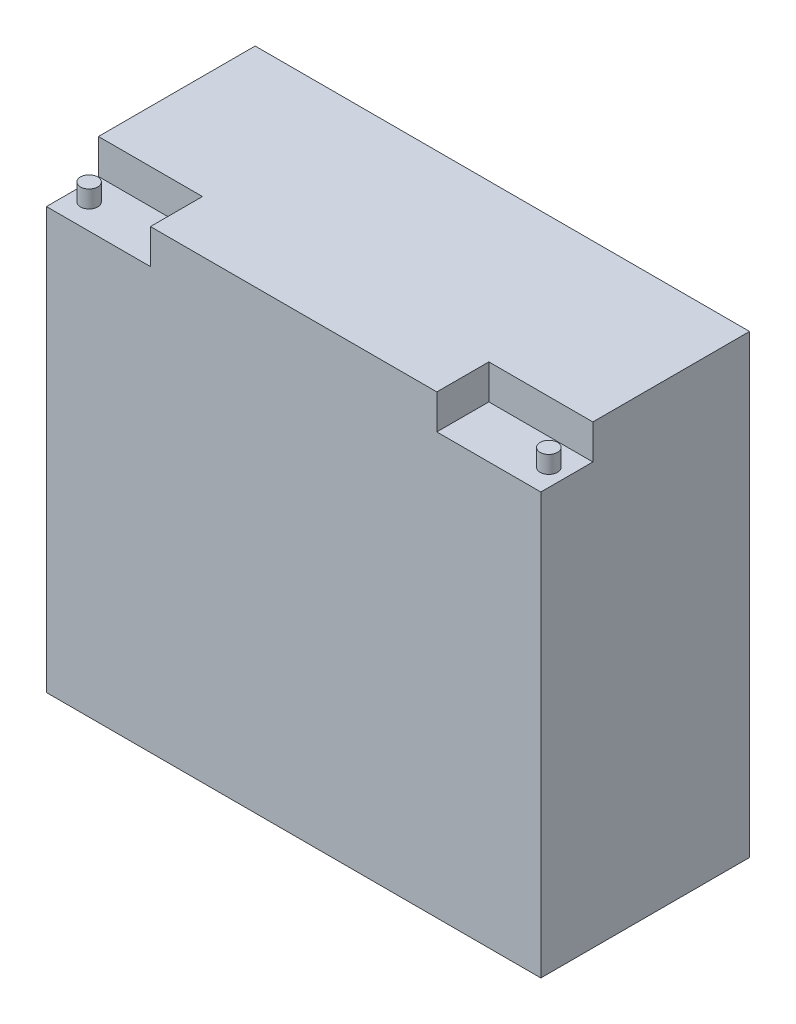
ISO-10303-21;
HEADER;
FILE_DESCRIPTION(('STEP AP214'),'2;1');
FILE_NAME('part.step','',(''),(''),'','','');
FILE_SCHEMA(('AUTOMOTIVE_DESIGN { 1 0 10303 214 1 1 1 1 }'));
ENDSEC;
DATA;
#1=APPLICATION_CONTEXT('core data for automotive mechanical design processes');
#2=APPLICATION_PROTOCOL_DEFINITION('international standard','automotive_design',2000,#1);
#3=PRODUCT_CONTEXT('',#1,'mechanical');
#4=PRODUCT('Part','Part','',(#3));
#5=PRODUCT_RELATED_PRODUCT_CATEGORY('part','',(#4));
#6=PRODUCT_DEFINITION_FORMATION('','',#4);
#7=PRODUCT_DEFINITION_CONTEXT('part definition',#1,'design');
#8=PRODUCT_DEFINITION('design','',#6,#7);
#9=PRODUCT_DEFINITION_SHAPE('','',#8);
#10=(LENGTH_UNIT() NAMED_UNIT(*) SI_UNIT(.MILLI.,.METRE.));
#11=(NAMED_UNIT(*) PLANE_ANGLE_UNIT() SI_UNIT($,.RADIAN.));
#12=(NAMED_UNIT(*) SI_UNIT($,.STERADIAN.) SOLID_ANGLE_UNIT());
#13=UNCERTAINTY_MEASURE_WITH_UNIT(LENGTH_MEASURE(1.E-05),#10,'distance_accuracy_value','');
#14=(GEOMETRIC_REPRESENTATION_CONTEXT(3) GLOBAL_UNCERTAINTY_ASSIGNED_CONTEXT((#13)) GLOBAL_UNIT_ASSIGNED_CONTEXT((#10,
#11,#12)) REPRESENTATION_CONTEXT('',''));
#15=CARTESIAN_POINT('',(0.,0.,0.));
#16=DIRECTION('',(0.,0.,1.));
#17=DIRECTION('',(1.,0.,0.));
#18=AXIS2_PLACEMENT_3D('',#15,#16,#17);
#19=CARTESIAN_POINT('',(-111.273787369558,166.878,8.26184527704025));
#20=DIRECTION('',(1.,0.,0.));
#21=DIRECTION('',(0.,0.,-1.));
#22=AXIS2_PLACEMENT_3D('',#19,#20,#21);
#23=PLANE('',#22);
#24=DIRECTION('',(0.,0.,1.));
#25=VECTOR('',#24,1.);
#26=CARTESIAN_POINT('',(-111.273787369558,154.178,65.6658452770402));
#27=LINE('',#26,#25);
#28=CARTESIAN_POINT('',(-111.273787369558,154.178,65.6658452770402));
#29=VERTEX_POINT('',#28);
#30=CARTESIAN_POINT('',(-111.273787369558,154.178,84.7158452770402));
#31=VERTEX_POINT('',#30);
#32=EDGE_CURVE('E114',#29,#31,#27,.T.);
#33=ORIENTED_EDGE('',*,*,#32,.F.);
#34=DIRECTION('',(0.,1.,0.));
#35=VECTOR('',#34,1.);
#36=CARTESIAN_POINT('',(-111.273787369558,154.178,65.6658452770402));
#37=LINE('',#36,#35);
#38=CARTESIAN_POINT('',(-111.273787369558,166.878,65.6658452770402));
#39=VERTEX_POINT('',#38);
#40=EDGE_CURVE('E143',#29,#39,#37,.T.);
#41=ORIENTED_EDGE('',*,*,#40,.T.);
#42=DIRECTION('',(0.,0.,1.));
#43=VECTOR('',#42,1.);
#44=CARTESIAN_POINT('',(-111.273787369558,166.878,8.26184527704025));
#45=LINE('',#44,#43);
#46=CARTESIAN_POINT('',(-111.273787369558,166.878,8.26184527704025));
#47=VERTEX_POINT('',#46);
#48=EDGE_CURVE('E156',#47,#39,#45,.T.);
#49=ORIENTED_EDGE('',*,*,#48,.F.);
#50=DIRECTION('',(0.,-1.,0.));
#51=VECTOR('',#50,1.);
#52=CARTESIAN_POINT('',(-111.273787369558,166.878,8.26184527704025));
#53=LINE('',#52,#51);
#54=CARTESIAN_POINT('',(-111.273787369558,0.,8.26184527704025));
#55=VERTEX_POINT('',#54);
#56=EDGE_CURVE('E139',#47,#55,#53,.T.);
#57=ORIENTED_EDGE('',*,*,#56,.T.);
#58=DIRECTION('',(0.,0.,1.));
#59=VECTOR('',#58,1.);
#60=CARTESIAN_POINT('',(-111.273787369558,0.,8.26184527704025));
#61=LINE('',#60,#59);
#62=CARTESIAN_POINT('',(-111.273787369558,0.,84.7158452770402));
#63=VERTEX_POINT('',#62);
#64=EDGE_CURVE('E136',#55,#63,#61,.T.);
#65=ORIENTED_EDGE('',*,*,#64,.T.);
#66=DIRECTION('',(0.,-1.,0.));
#67=VECTOR('',#66,1.);
#68=CARTESIAN_POINT('',(-111.273787369558,166.878,84.7158452770402));
#69=LINE('',#68,#67);
#70=EDGE_CURVE('E11',#31,#63,#69,.T.);
#71=ORIENTED_EDGE('',*,*,#70,.F.);
#72=EDGE_LOOP('',(#33,#41,#49,#57,#65,#71));
#73=FACE_BOUND('',#72,.T.);
#74=ADVANCED_FACE('F36',(#73),#23,.F.);
#75=CARTESIAN_POINT('',(-111.273787369558,166.878,84.7158452770402));
#76=DIRECTION('',(0.,0.,-1.));
#77=DIRECTION('',(-1.,0.,0.));
#78=AXIS2_PLACEMENT_3D('',#75,#76,#77);
#79=PLANE('',#78);
#80=DIRECTION('',(1.,0.,0.));
#81=VECTOR('',#80,1.);
#82=CARTESIAN_POINT('',(-111.273787369558,166.878,84.7158452770402));
#83=LINE('',#82,#81);
#84=CARTESIAN_POINT('',(-73.1737873695584,166.878,84.7158452770402));
#85=VERTEX_POINT('',#84);
#86=CARTESIAN_POINT('',(31.7282126304416,166.878,84.7158452770402));
#87=VERTEX_POINT('',#86);
#88=EDGE_CURVE('E176',#85,#87,#83,.T.);
#89=ORIENTED_EDGE('',*,*,#88,.F.);
#90=DIRECTION('',(0.,1.,0.));
#91=VECTOR('',#90,1.);
#92=CARTESIAN_POINT('',(-73.1737873695584,154.178,84.7158452770402));
#93=LINE('',#92,#91);
#94=CARTESIAN_POINT('',(-73.1737873695584,154.178,84.7158452770402));
#95=VERTEX_POINT('',#94);
#96=EDGE_CURVE('E58',#95,#85,#93,.T.);
#97=ORIENTED_EDGE('',*,*,#96,.F.);
#98=DIRECTION('',(1.,0.,0.));
#99=VECTOR('',#98,1.);
#100=CARTESIAN_POINT('',(-111.273787369558,154.178,84.7158452770402));
#101=LINE('',#100,#99);
#102=EDGE_CURVE('E118',#31,#95,#101,.T.);
#103=ORIENTED_EDGE('',*,*,#102,.F.);
#104=ORIENTED_EDGE('',*,*,#70,.T.);
#105=DIRECTION('',(1.,0.,0.));
#106=VECTOR('',#105,1.);
#107=CARTESIAN_POINT('',(-111.273787369558,0.,84.7158452770402));
#108=LINE('',#107,#106);
#109=CARTESIAN_POINT('',(69.8282126304416,0.,84.7158452770402));
#110=VERTEX_POINT('',#109);
#111=EDGE_CURVE('E142',#63,#110,#108,.T.);
#112=ORIENTED_EDGE('',*,*,#111,.T.);
#113=DIRECTION('',(0.,-1.,0.));
#114=VECTOR('',#113,1.);
#115=CARTESIAN_POINT('',(69.8282126304416,166.878,84.7158452770402));
#116=LINE('',#115,#114);
#117=CARTESIAN_POINT('',(69.8282126304416,154.178,84.7158452770402));
#118=VERTEX_POINT('',#117);
#119=EDGE_CURVE('E43',#118,#110,#116,.T.);
#120=ORIENTED_EDGE('',*,*,#119,.F.);
#121=DIRECTION('',(1.,0.,0.));
#122=VECTOR('',#121,1.);
#123=CARTESIAN_POINT('',(69.8282126304416,154.178,84.7158452770402));
#124=LINE('',#123,#122);
#125=CARTESIAN_POINT('',(31.7282126304416,154.178,84.7158452770402));
#126=VERTEX_POINT('',#125);
#127=EDGE_CURVE('E184',#126,#118,#124,.T.);
#128=ORIENTED_EDGE('',*,*,#127,.F.);
#129=DIRECTION('',(0.,1.,0.));
#130=VECTOR('',#129,1.);
#131=CARTESIAN_POINT('',(31.7282126304416,154.178,84.7158452770402));
#132=LINE('',#131,#130);
#133=EDGE_CURVE('E186',#126,#87,#132,.T.);
#134=ORIENTED_EDGE('',*,*,#133,.T.);
#135=EDGE_LOOP('',(#89,#97,#103,#104,#112,#120,#128,#134));
#136=FACE_BOUND('',#135,.T.);
#137=ADVANCED_FACE('F128',(#136),#79,.F.);
#138=CARTESIAN_POINT('',(69.8282126304416,166.878,8.26184527704025));
#139=DIRECTION('',(-1.,0.,0.));
#140=DIRECTION('',(0.,0.,1.));
#141=AXIS2_PLACEMENT_3D('',#138,#139,#140);
#142=PLANE('',#141);
#143=DIRECTION('',(0.,0.,-1.));
#144=VECTOR('',#143,1.);
#145=CARTESIAN_POINT('',(69.8282126304416,166.878,8.26184527704025));
#146=LINE('',#145,#144);
#147=CARTESIAN_POINT('',(69.8282126304416,166.878,65.6658452770402));
#148=VERTEX_POINT('',#147);
#149=CARTESIAN_POINT('',(69.8282126304416,166.878,8.26184527704025));
#150=VERTEX_POINT('',#149);
#151=EDGE_CURVE('E174',#148,#150,#146,.T.);
#152=ORIENTED_EDGE('',*,*,#151,.F.);
#153=DIRECTION('',(0.,1.,0.));
#154=VECTOR('',#153,1.);
#155=CARTESIAN_POINT('',(69.8282126304416,154.178,65.6658452770402));
#156=LINE('',#155,#154);
#157=CARTESIAN_POINT('',(69.8282126304416,154.178,65.6658452770402));
#158=VERTEX_POINT('',#157);
#159=EDGE_CURVE('E50',#158,#148,#156,.T.);
#160=ORIENTED_EDGE('',*,*,#159,.F.);
#161=DIRECTION('',(0.,0.,-1.));
#162=VECTOR('',#161,1.);
#163=CARTESIAN_POINT('',(69.8282126304416,154.178,84.7158452770402));
#164=LINE('',#163,#162);
#165=EDGE_CURVE('E168',#118,#158,#164,.T.);
#166=ORIENTED_EDGE('',*,*,#165,.F.);
#167=ORIENTED_EDGE('',*,*,#119,.T.);
#168=DIRECTION('',(0.,0.,-1.));
#169=VECTOR('',#168,1.);
#170=CARTESIAN_POINT('',(69.8282126304416,0.,8.26184527704025));
#171=LINE('',#170,#169);
#172=CARTESIAN_POINT('',(69.8282126304416,0.,8.26184527704025));
#173=VERTEX_POINT('',#172);
#174=EDGE_CURVE('E145',#110,#173,#171,.T.);
#175=ORIENTED_EDGE('',*,*,#174,.T.);
#176=DIRECTION('',(0.,-1.,0.));
#177=VECTOR('',#176,1.);
#178=CARTESIAN_POINT('',(69.8282126304416,166.878,8.26184527704025));
#179=LINE('',#178,#177);
#180=EDGE_CURVE('E158',#150,#173,#179,.T.);
#181=ORIENTED_EDGE('',*,*,#180,.F.);
#182=EDGE_LOOP('',(#152,#160,#166,#167,#175,#181));
#183=FACE_BOUND('',#182,.T.);
#184=ADVANCED_FACE('F164',(#183),#142,.F.);
#185=CARTESIAN_POINT('',(-111.273787369558,166.878,8.26184527704025));
#186=DIRECTION('',(0.,0.,1.));
#187=DIRECTION('',(1.,0.,0.));
#188=AXIS2_PLACEMENT_3D('',#185,#186,#187);
#189=PLANE('',#188);
#190=DIRECTION('',(-1.,0.,0.));
#191=VECTOR('',#190,1.);
#192=CARTESIAN_POINT('',(-111.273787369558,0.,8.26184527704025));
#193=LINE('',#192,#191);
#194=EDGE_CURVE('E154',#173,#55,#193,.T.);
#195=ORIENTED_EDGE('',*,*,#194,.T.);
#196=ORIENTED_EDGE('',*,*,#56,.F.);
#197=DIRECTION('',(-1.,0.,0.));
#198=VECTOR('',#197,1.);
#199=CARTESIAN_POINT('',(-111.273787369558,166.878,8.26184527704025));
#200=LINE('',#199,#198);
#201=EDGE_CURVE('E150',#150,#47,#200,.T.);
#202=ORIENTED_EDGE('',*,*,#201,.F.);
#203=ORIENTED_EDGE('',*,*,#180,.T.);
#204=EDGE_LOOP('',(#195,#196,#202,#203));
#205=FACE_BOUND('',#204,.T.);
#206=ADVANCED_FACE('F172',(#205),#189,.F.);
#207=CARTESIAN_POINT('',(0.,166.878,0.));
#208=DIRECTION('',(0.,1.,0.));
#209=DIRECTION('',(0.,0.,1.));
#210=AXIS2_PLACEMENT_3D('',#207,#208,#209);
#211=PLANE('',#210);
#212=DIRECTION('',(-1.,0.,0.));
#213=VECTOR('',#212,1.);
#214=CARTESIAN_POINT('',(-111.273787369558,166.878,65.6658452770402));
#215=LINE('',#214,#213);
#216=CARTESIAN_POINT('',(-73.1737873695584,166.878,65.6658452770402));
#217=VERTEX_POINT('',#216);
#218=EDGE_CURVE('E124',#217,#39,#215,.T.);
#219=ORIENTED_EDGE('',*,*,#218,.F.);
#220=DIRECTION('',(0.,0.,-1.));
#221=VECTOR('',#220,1.);
#222=CARTESIAN_POINT('',(-73.1737873695584,166.878,65.6658452770402));
#223=LINE('',#222,#221);
#224=EDGE_CURVE('E189',#85,#217,#223,.T.);
#225=ORIENTED_EDGE('',*,*,#224,.F.);
#226=ORIENTED_EDGE('',*,*,#88,.T.);
#227=DIRECTION('',(0.,0.,1.));
#228=VECTOR('',#227,1.);
#229=CARTESIAN_POINT('',(31.7282126304416,166.878,84.7158452770402));
#230=LINE('',#229,#228);
#231=CARTESIAN_POINT('',(31.7282126304416,166.878,65.6658452770402));
#232=VERTEX_POINT('',#231);
#233=EDGE_CURVE('E190',#232,#87,#230,.T.);
#234=ORIENTED_EDGE('',*,*,#233,.F.);
#235=DIRECTION('',(-1.,0.,0.));
#236=VECTOR('',#235,1.);
#237=CARTESIAN_POINT('',(69.8282126304416,166.878,65.6658452770402));
#238=LINE('',#237,#236);
#239=EDGE_CURVE('E192',#148,#232,#238,.T.);
#240=ORIENTED_EDGE('',*,*,#239,.F.);
#241=ORIENTED_EDGE('',*,*,#151,.T.);
#242=ORIENTED_EDGE('',*,*,#201,.T.);
#243=ORIENTED_EDGE('',*,*,#48,.T.);
#244=EDGE_LOOP('',(#219,#225,#226,#234,#240,#241,#242,#243));
#245=FACE_BOUND('',#244,.T.);
#246=ADVANCED_FACE('F254',(#245),#211,.T.);
#247=CARTESIAN_POINT('',(0.,0.,0.));
#248=DIRECTION('',(0.,1.,0.));
#249=DIRECTION('',(0.,0.,1.));
#250=AXIS2_PLACEMENT_3D('',#247,#248,#249);
#251=PLANE('',#250);
#252=ORIENTED_EDGE('',*,*,#64,.F.);
#253=ORIENTED_EDGE('',*,*,#194,.F.);
#254=ORIENTED_EDGE('',*,*,#174,.F.);
#255=ORIENTED_EDGE('',*,*,#111,.F.);
#256=EDGE_LOOP('',(#252,#253,#254,#255));
#257=FACE_BOUND('',#256,.T.);
#258=ADVANCED_FACE('F170',(#257),#251,.F.);
#259=CARTESIAN_POINT('',(31.7282126304416,154.178,84.7158452770402));
#260=DIRECTION('',(-1.,0.,0.));
#261=DIRECTION('',(0.,0.,1.));
#262=AXIS2_PLACEMENT_3D('',#259,#260,#261);
#263=PLANE('',#262);
#264=ORIENTED_EDGE('',*,*,#233,.T.);
#265=ORIENTED_EDGE('',*,*,#133,.F.);
#266=DIRECTION('',(0.,0.,1.));
#267=VECTOR('',#266,1.);
#268=CARTESIAN_POINT('',(31.7282126304416,154.178,84.7158452770402));
#269=LINE('',#268,#267);
#270=CARTESIAN_POINT('',(31.7282126304416,154.178,65.6658452770402));
#271=VERTEX_POINT('',#270);
#272=EDGE_CURVE('E196',#271,#126,#269,.T.);
#273=ORIENTED_EDGE('',*,*,#272,.F.);
#274=DIRECTION('',(0.,1.,0.));
#275=VECTOR('',#274,1.);
#276=CARTESIAN_POINT('',(31.7282126304416,154.178,65.6658452770402));
#277=LINE('',#276,#275);
#278=EDGE_CURVE('E183',#271,#232,#277,.T.);
#279=ORIENTED_EDGE('',*,*,#278,.T.);
#280=EDGE_LOOP('',(#264,#265,#273,#279));
#281=FACE_BOUND('',#280,.T.);
#282=ADVANCED_FACE('F257',(#281),#263,.F.);
#283=CARTESIAN_POINT('',(69.8282126304416,154.178,65.6658452770402));
#284=DIRECTION('',(0.,0.,-1.));
#285=DIRECTION('',(-1.,0.,0.));
#286=AXIS2_PLACEMENT_3D('',#283,#284,#285);
#287=PLANE('',#286);
#288=ORIENTED_EDGE('',*,*,#239,.T.);
#289=ORIENTED_EDGE('',*,*,#278,.F.);
#290=DIRECTION('',(-1.,0.,0.));
#291=VECTOR('',#290,1.);
#292=CARTESIAN_POINT('',(69.8282126304416,154.178,65.6658452770402));
#293=LINE('',#292,#291);
#294=EDGE_CURVE('E199',#158,#271,#293,.T.);
#295=ORIENTED_EDGE('',*,*,#294,.F.);
#296=ORIENTED_EDGE('',*,*,#159,.T.);
#297=EDGE_LOOP('',(#288,#289,#295,#296));
#298=FACE_BOUND('',#297,.T.);
#299=ADVANCED_FACE('F260',(#298),#287,.F.);
#300=CARTESIAN_POINT('',(0.,154.178,0.));
#301=DIRECTION('',(0.,1.,0.));
#302=DIRECTION('',(0.,0.,1.));
#303=AXIS2_PLACEMENT_3D('',#300,#301,#302);
#304=PLANE('',#303);
#305=CARTESIAN_POINT('',(63.4782126304416,154.178,75.4437672715007));
#306=DIRECTION('',(0.,1.,0.));
#307=DIRECTION('',(0.,0.,1.));
#308=AXIS2_PLACEMENT_3D('',#305,#306,#307);
#309=CIRCLE('',#308,3.175);
#310=CARTESIAN_POINT('',(63.4782126304416,154.178,78.6187672715007));
#311=VERTEX_POINT('',#310);
#312=EDGE_CURVE('E209',#311,#311,#309,.T.);
#313=ORIENTED_EDGE('',*,*,#312,.F.);
#314=EDGE_LOOP('',(#313));
#315=FACE_BOUND('',#314,.T.);
#316=ORIENTED_EDGE('',*,*,#165,.T.);
#317=ORIENTED_EDGE('',*,*,#294,.T.);
#318=ORIENTED_EDGE('',*,*,#272,.T.);
#319=ORIENTED_EDGE('',*,*,#127,.T.);
#320=EDGE_LOOP('',(#316,#317,#318,#319));
#321=FACE_BOUND('',#320,.T.);
#322=ADVANCED_FACE('F263',(#315,#321),#304,.T.);
#323=CARTESIAN_POINT('',(-111.273787369558,154.178,65.6658452770402));
#324=DIRECTION('',(0.,0.,-1.));
#325=DIRECTION('',(-1.,0.,0.));
#326=AXIS2_PLACEMENT_3D('',#323,#324,#325);
#327=PLANE('',#326);
#328=ORIENTED_EDGE('',*,*,#218,.T.);
#329=ORIENTED_EDGE('',*,*,#40,.F.);
#330=DIRECTION('',(-1.,0.,0.));
#331=VECTOR('',#330,1.);
#332=CARTESIAN_POINT('',(-111.273787369558,154.178,65.6658452770402));
#333=LINE('',#332,#331);
#334=CARTESIAN_POINT('',(-73.1737873695584,154.178,65.6658452770402));
#335=VERTEX_POINT('',#334);
#336=EDGE_CURVE('E120',#335,#29,#333,.T.);
#337=ORIENTED_EDGE('',*,*,#336,.F.);
#338=DIRECTION('',(0.,1.,0.));
#339=VECTOR('',#338,1.);
#340=CARTESIAN_POINT('',(-73.1737873695584,154.178,65.6658452770402));
#341=LINE('',#340,#339);
#342=EDGE_CURVE('E147',#335,#217,#341,.T.);
#343=ORIENTED_EDGE('',*,*,#342,.T.);
#344=EDGE_LOOP('',(#328,#329,#337,#343));
#345=FACE_BOUND('',#344,.T.);
#346=ADVANCED_FACE('F240',(#345),#327,.F.);
#347=CARTESIAN_POINT('',(-73.1737873695584,154.178,65.6658452770402));
#348=DIRECTION('',(1.,0.,0.));
#349=DIRECTION('',(0.,0.,-1.));
#350=AXIS2_PLACEMENT_3D('',#347,#348,#349);
#351=PLANE('',#350);
#352=ORIENTED_EDGE('',*,*,#224,.T.);
#353=ORIENTED_EDGE('',*,*,#342,.F.);
#354=DIRECTION('',(0.,0.,-1.));
#355=VECTOR('',#354,1.);
#356=CARTESIAN_POINT('',(-73.1737873695584,154.178,65.6658452770402));
#357=LINE('',#356,#355);
#358=EDGE_CURVE('E131',#95,#335,#357,.T.);
#359=ORIENTED_EDGE('',*,*,#358,.F.);
#360=ORIENTED_EDGE('',*,*,#96,.T.);
#361=EDGE_LOOP('',(#352,#353,#359,#360));
#362=FACE_BOUND('',#361,.T.);
#363=ADVANCED_FACE('F232',(#362),#351,.F.);
#364=CARTESIAN_POINT('',(0.,154.178,0.));
#365=DIRECTION('',(0.,1.,0.));
#366=DIRECTION('',(0.,0.,1.));
#367=AXIS2_PLACEMENT_3D('',#364,#365,#366);
#368=PLANE('',#367);
#369=CARTESIAN_POINT('',(-104.923787369558,154.178,75.4437672715007));
#370=DIRECTION('',(0.,1.,0.));
#371=DIRECTION('',(0.,0.,1.));
#372=AXIS2_PLACEMENT_3D('',#369,#370,#371);
#373=CIRCLE('',#372,3.175);
#374=CARTESIAN_POINT('',(-104.923787369558,154.178,78.6187672715007));
#375=VERTEX_POINT('',#374);
#376=EDGE_CURVE('E215',#375,#375,#373,.T.);
#377=ORIENTED_EDGE('',*,*,#376,.F.);
#378=EDGE_LOOP('',(#377));
#379=FACE_BOUND('',#378,.T.);
#380=ORIENTED_EDGE('',*,*,#32,.T.);
#381=ORIENTED_EDGE('',*,*,#102,.T.);
#382=ORIENTED_EDGE('',*,*,#358,.T.);
#383=ORIENTED_EDGE('',*,*,#336,.T.);
#384=EDGE_LOOP('',(#380,#381,#382,#383));
#385=FACE_BOUND('',#384,.T.);
#386=ADVANCED_FACE('F116',(#379,#385),#368,.T.);
#387=CARTESIAN_POINT('',(63.4782126304416,160.528,75.4437672715007));
#388=DIRECTION('',(0.,-1.,0.));
#389=DIRECTION('',(0.,0.,-1.));
#390=AXIS2_PLACEMENT_3D('',#387,#388,#389);
#391=CYLINDRICAL_SURFACE('',#390,3.175);
#392=CARTESIAN_POINT('',(63.4782126304416,160.528,75.4437672715007));
#393=DIRECTION('',(0.,1.,0.));
#394=DIRECTION('',(0.,0.,1.));
#395=AXIS2_PLACEMENT_3D('',#392,#393,#394);
#396=CIRCLE('',#395,3.175);
#397=CARTESIAN_POINT('',(63.4782126304416,160.528,78.6187672715007));
#398=VERTEX_POINT('',#397);
#399=EDGE_CURVE('E194',#398,#398,#396,.T.);
#400=ORIENTED_EDGE('',*,*,#399,.F.);
#401=EDGE_LOOP('',(#400));
#402=FACE_BOUND('',#401,.T.);
#403=ORIENTED_EDGE('',*,*,#312,.T.);
#404=EDGE_LOOP('',(#403));
#405=FACE_BOUND('',#404,.T.);
#406=ADVANCED_FACE('F231',(#402,#405),#391,.T.);
#407=CARTESIAN_POINT('',(63.4782126304416,160.528,75.4437672715007));
#408=DIRECTION('',(0.,1.,0.));
#409=DIRECTION('',(0.,0.,1.));
#410=AXIS2_PLACEMENT_3D('',#407,#408,#409);
#411=PLANE('',#410);
#412=ORIENTED_EDGE('',*,*,#399,.T.);
#413=EDGE_LOOP('',(#412));
#414=FACE_BOUND('',#413,.T.);
#415=ADVANCED_FACE('F226',(#414),#411,.T.);
#416=CARTESIAN_POINT('',(-104.923787369558,160.528,75.4437672715007));
#417=DIRECTION('',(0.,-1.,0.));
#418=DIRECTION('',(0.,0.,-1.));
#419=AXIS2_PLACEMENT_3D('',#416,#417,#418);
#420=CYLINDRICAL_SURFACE('',#419,3.175);
#421=CARTESIAN_POINT('',(-104.923787369558,160.528,75.4437672715007));
#422=DIRECTION('',(0.,1.,0.));
#423=DIRECTION('',(0.,0.,1.));
#424=AXIS2_PLACEMENT_3D('',#421,#422,#423);
#425=CIRCLE('',#424,3.175);
#426=CARTESIAN_POINT('',(-104.923787369558,160.528,78.6187672715007));
#427=VERTEX_POINT('',#426);
#428=EDGE_CURVE('E212',#427,#427,#425,.T.);
#429=ORIENTED_EDGE('',*,*,#428,.F.);
#430=EDGE_LOOP('',(#429));
#431=FACE_BOUND('',#430,.T.);
#432=ORIENTED_EDGE('',*,*,#376,.T.);
#433=EDGE_LOOP('',(#432));
#434=FACE_BOUND('',#433,.T.);
#435=ADVANCED_FACE('F223',(#431,#434),#420,.T.);
#436=CARTESIAN_POINT('',(-104.923787369558,160.528,75.4437672715007));
#437=DIRECTION('',(0.,1.,0.));
#438=DIRECTION('',(0.,0.,1.));
#439=AXIS2_PLACEMENT_3D('',#436,#437,#438);
#440=PLANE('',#439);
#441=ORIENTED_EDGE('',*,*,#428,.T.);
#442=EDGE_LOOP('',(#441));
#443=FACE_BOUND('',#442,.T.);
#444=ADVANCED_FACE('F221',(#443),#440,.T.);
#445=CLOSED_SHELL('',(#74,#137,#184,#206,#246,#258,#282,#299,#322,#346,#363,#386,#406,#415,#435,#444));
#446=MANIFOLD_SOLID_BREP('B2',#445);
#447=ADVANCED_BREP_SHAPE_REPRESENTATION('',(#18,#446),#14);
#448=SHAPE_DEFINITION_REPRESENTATION(#9,#447);
ENDSEC;
END-ISO-10303-21;
